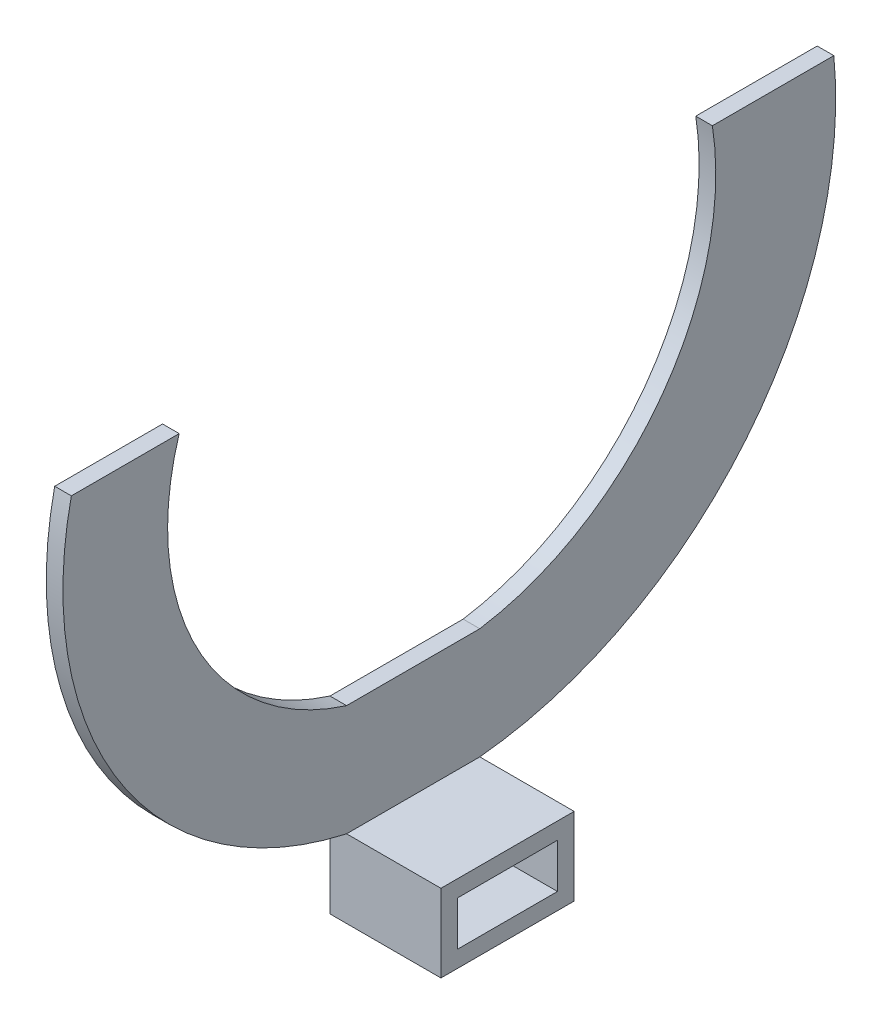
ISO-10303-21;
HEADER;
FILE_DESCRIPTION(('STEP AP214'),'2;1');
FILE_NAME('part.step','',(''),(''),'','','');
FILE_SCHEMA(('AUTOMOTIVE_DESIGN { 1 0 10303 214 1 1 1 1 }'));
ENDSEC;
DATA;
#1=APPLICATION_CONTEXT('core data for automotive mechanical design processes');
#2=APPLICATION_PROTOCOL_DEFINITION('international standard','automotive_design',2000,#1);
#3=PRODUCT_CONTEXT('',#1,'mechanical');
#4=PRODUCT('Part','Part','',(#3));
#5=PRODUCT_RELATED_PRODUCT_CATEGORY('part','',(#4));
#6=PRODUCT_DEFINITION_FORMATION('','',#4);
#7=PRODUCT_DEFINITION_CONTEXT('part definition',#1,'design');
#8=PRODUCT_DEFINITION('design','',#6,#7);
#9=PRODUCT_DEFINITION_SHAPE('','',#8);
#10=(LENGTH_UNIT() NAMED_UNIT(*) SI_UNIT(.MILLI.,.METRE.));
#11=(NAMED_UNIT(*) PLANE_ANGLE_UNIT() SI_UNIT($,.RADIAN.));
#12=(NAMED_UNIT(*) SI_UNIT($,.STERADIAN.) SOLID_ANGLE_UNIT());
#13=UNCERTAINTY_MEASURE_WITH_UNIT(LENGTH_MEASURE(1.E-05),#10,'distance_accuracy_value','');
#14=(GEOMETRIC_REPRESENTATION_CONTEXT(3) GLOBAL_UNCERTAINTY_ASSIGNED_CONTEXT((#13)) GLOBAL_UNIT_ASSIGNED_CONTEXT((#10,
#11,#12)) REPRESENTATION_CONTEXT('',''));
#15=CARTESIAN_POINT('',(0.,0.,0.));
#16=DIRECTION('',(0.,0.,1.));
#17=DIRECTION('',(1.,0.,0.));
#18=AXIS2_PLACEMENT_3D('',#15,#16,#17);
#19=CARTESIAN_POINT('',(20.,14.,0.));
#20=DIRECTION('',(0.,-1.,0.));
#21=DIRECTION('',(0.,0.,-1.));
#22=AXIS2_PLACEMENT_3D('',#19,#20,#21);
#23=PLANE('',#22);
#24=DIRECTION('',(0.,0.,-1.));
#25=VECTOR('',#24,1.);
#26=CARTESIAN_POINT('',(3.,14.,-24.));
#27=LINE('',#26,#25);
#28=CARTESIAN_POINT('',(3.,14.,0.));
#29=VERTEX_POINT('',#28);
#30=CARTESIAN_POINT('',(3.,14.,-24.));
#31=VERTEX_POINT('',#30);
#32=EDGE_CURVE('E253',#29,#31,#27,.T.);
#33=ORIENTED_EDGE('',*,*,#32,.F.);
#34=DIRECTION('',(-1.,0.,0.));
#35=VECTOR('',#34,1.);
#36=CARTESIAN_POINT('',(20.,14.,0.));
#37=LINE('',#36,#35);
#38=CARTESIAN_POINT('',(20.,14.,0.));
#39=VERTEX_POINT('',#38);
#40=EDGE_CURVE('E193',#39,#29,#37,.T.);
#41=ORIENTED_EDGE('',*,*,#40,.F.);
#42=DIRECTION('',(0.,0.,1.));
#43=VECTOR('',#42,1.);
#44=CARTESIAN_POINT('',(20.,14.,0.));
#45=LINE('',#44,#43);
#46=CARTESIAN_POINT('',(20.,14.,-24.));
#47=VERTEX_POINT('',#46);
#48=EDGE_CURVE('E198',#47,#39,#45,.T.);
#49=ORIENTED_EDGE('',*,*,#48,.F.);
#50=DIRECTION('',(-1.,0.,0.));
#51=VECTOR('',#50,1.);
#52=CARTESIAN_POINT('',(20.,14.,-24.));
#53=LINE('',#52,#51);
#54=EDGE_CURVE('E197',#47,#31,#53,.T.);
#55=ORIENTED_EDGE('',*,*,#54,.T.);
#56=EDGE_LOOP('',(#33,#41,#49,#55));
#57=FACE_BOUND('',#56,.T.);
#58=ADVANCED_FACE('F39',(#57),#23,.F.);
#59=CARTESIAN_POINT('',(20.,0.,0.));
#60=DIRECTION('',(-1.,0.,0.));
#61=DIRECTION('',(0.,0.,1.));
#62=AXIS2_PLACEMENT_3D('',#59,#60,#61);
#63=PLANE('',#62);
#64=DIRECTION('',(0.,-1.,0.));
#65=VECTOR('',#64,1.);
#66=CARTESIAN_POINT('',(20.,0.,0.));
#67=LINE('',#66,#65);
#68=CARTESIAN_POINT('',(20.,0.,0.));
#69=VERTEX_POINT('',#68);
#70=EDGE_CURVE('E181',#39,#69,#67,.T.);
#71=ORIENTED_EDGE('',*,*,#70,.T.);
#72=DIRECTION('',(0.,0.,-1.));
#73=VECTOR('',#72,1.);
#74=CARTESIAN_POINT('',(20.,0.,0.));
#75=LINE('',#74,#73);
#76=CARTESIAN_POINT('',(20.,0.,-24.));
#77=VERTEX_POINT('',#76);
#78=EDGE_CURVE('E187',#69,#77,#75,.T.);
#79=ORIENTED_EDGE('',*,*,#78,.T.);
#80=DIRECTION('',(0.,1.,0.));
#81=VECTOR('',#80,1.);
#82=CARTESIAN_POINT('',(20.,0.,-24.));
#83=LINE('',#82,#81);
#84=EDGE_CURVE('E203',#77,#47,#83,.T.);
#85=ORIENTED_EDGE('',*,*,#84,.T.);
#86=ORIENTED_EDGE('',*,*,#48,.T.);
#87=EDGE_LOOP('',(#71,#79,#85,#86));
#88=FACE_BOUND('',#87,.T.);
#89=DIRECTION('',(0.,-1.,0.));
#90=VECTOR('',#89,1.);
#91=CARTESIAN_POINT('',(20.,3.,-3.));
#92=LINE('',#91,#90);
#93=CARTESIAN_POINT('',(20.,11.,-3.));
#94=VERTEX_POINT('',#93);
#95=CARTESIAN_POINT('',(20.,3.,-3.));
#96=VERTEX_POINT('',#95);
#97=EDGE_CURVE('E231',#94,#96,#92,.T.);
#98=ORIENTED_EDGE('',*,*,#97,.F.);
#99=DIRECTION('',(0.,0.,1.));
#100=VECTOR('',#99,1.);
#101=CARTESIAN_POINT('',(20.,11.,-3.));
#102=LINE('',#101,#100);
#103=CARTESIAN_POINT('',(20.,11.,-21.));
#104=VERTEX_POINT('',#103);
#105=EDGE_CURVE('E226',#104,#94,#102,.T.);
#106=ORIENTED_EDGE('',*,*,#105,.F.);
#107=DIRECTION('',(0.,1.,0.));
#108=VECTOR('',#107,1.);
#109=CARTESIAN_POINT('',(20.,3.,-21.));
#110=LINE('',#109,#108);
#111=CARTESIAN_POINT('',(20.,3.,-21.));
#112=VERTEX_POINT('',#111);
#113=EDGE_CURVE('E245',#112,#104,#110,.T.);
#114=ORIENTED_EDGE('',*,*,#113,.F.);
#115=DIRECTION('',(0.,0.,-1.));
#116=VECTOR('',#115,1.);
#117=CARTESIAN_POINT('',(20.,3.,-3.));
#118=LINE('',#117,#116);
#119=EDGE_CURVE('E248',#96,#112,#118,.T.);
#120=ORIENTED_EDGE('',*,*,#119,.F.);
#121=EDGE_LOOP('',(#98,#106,#114,#120));
#122=FACE_BOUND('',#121,.T.);
#123=ADVANCED_FACE('F350',(#88,#122),#63,.F.);
#124=CARTESIAN_POINT('',(0.,0.,0.));
#125=DIRECTION('',(-1.,0.,0.));
#126=DIRECTION('',(0.,0.,1.));
#127=AXIS2_PLACEMENT_3D('',#124,#125,#126);
#128=PLANE('',#127);
#129=DIRECTION('',(0.,-1.,0.));
#130=VECTOR('',#129,1.);
#131=CARTESIAN_POINT('',(0.,0.,0.));
#132=LINE('',#131,#130);
#133=CARTESIAN_POINT('',(0.,14.,0.));
#134=VERTEX_POINT('',#133);
#135=CARTESIAN_POINT('',(0.,0.,0.));
#136=VERTEX_POINT('',#135);
#137=EDGE_CURVE('E189',#134,#136,#132,.T.);
#138=ORIENTED_EDGE('',*,*,#137,.F.);
#139=CARTESIAN_POINT('',(0.,77.560637064683,-13.9683624829845));
#140=DIRECTION('',(1.,0.,0.));
#141=DIRECTION('',(0.,0.,1.));
#142=AXIS2_PLACEMENT_3D('',#139,#140,#141);
#143=CIRCLE('',#142,65.0774133976175);
#144=CARTESIAN_POINT('',(0.,91.5289995476634,49.5922745816994));
#145=VERTEX_POINT('',#144);
#146=EDGE_CURVE('E277',#145,#134,#143,.T.);
#147=ORIENTED_EDGE('',*,*,#146,.F.);
#148=DIRECTION('',(0.,0.,1.));
#149=VECTOR('',#148,1.);
#150=CARTESIAN_POINT('',(0.,91.5289995476634,49.5922745816994));
#151=LINE('',#150,#149);
#152=CARTESIAN_POINT('',(0.,91.5289995476634,30.1601450300538));
#153=VERTEX_POINT('',#152);
#154=EDGE_CURVE('E298',#153,#145,#151,.T.);
#155=ORIENTED_EDGE('',*,*,#154,.F.);
#156=CARTESIAN_POINT('',(0.,77.8445722888607,-13.6844272588087));
#157=DIRECTION('',(-1.,0.,0.));
#158=DIRECTION('',(0.,0.,1.));
#159=AXIS2_PLACEMENT_3D('',#156,#157,#158);
#160=CIRCLE('',#159,45.9304917086107);
#161=CARTESIAN_POINT('',(0.,34.,0.));
#162=VERTEX_POINT('',#161);
#163=EDGE_CURVE('E286',#162,#153,#160,.T.);
#164=ORIENTED_EDGE('',*,*,#163,.F.);
#165=DIRECTION('',(0.,0.,1.));
#166=VECTOR('',#165,1.);
#167=CARTESIAN_POINT('',(0.,34.,-24.));
#168=LINE('',#167,#166);
#169=CARTESIAN_POINT('',(0.,34.,-24.));
#170=VERTEX_POINT('',#169);
#171=EDGE_CURVE('E257',#170,#162,#168,.T.);
#172=ORIENTED_EDGE('',*,*,#171,.F.);
#173=CARTESIAN_POINT('',(0.,83.7193465963251,-16.1903470486617));
#174=DIRECTION('',(-1.,0.,0.));
#175=DIRECTION('',(0.,0.,-1.));
#176=AXIS2_PLACEMENT_3D('',#173,#174,#175);
#177=CIRCLE('',#176,50.3289589121994);
#178=CARTESIAN_POINT('',(0.,91.5289995476634,-65.9096936449868));
#179=VERTEX_POINT('',#178);
#180=EDGE_CURVE('E174',#179,#170,#177,.T.);
#181=ORIENTED_EDGE('',*,*,#180,.F.);
#182=DIRECTION('',(0.,0.,1.));
#183=VECTOR('',#182,1.);
#184=CARTESIAN_POINT('',(0.,91.5289995476634,-65.9096936449868));
#185=LINE('',#184,#183);
#186=CARTESIAN_POINT('',(0.,91.5289995476633,-87.7921343039123));
#187=VERTEX_POINT('',#186);
#188=EDGE_CURVE('E162',#187,#179,#185,.T.);
#189=ORIENTED_EDGE('',*,*,#188,.F.);
#190=CARTESIAN_POINT('',(0.,84.6605669257878,-17.1315673781245));
#191=DIRECTION('',(1.,0.,0.));
#192=DIRECTION('',(0.,0.,-1.));
#193=AXIS2_PLACEMENT_3D('',#190,#191,#192);
#194=CIRCLE('',#193,70.9935989012741);
#195=CARTESIAN_POINT('',(0.,14.,-24.));
#196=VERTEX_POINT('',#195);
#197=EDGE_CURVE('E152',#196,#187,#194,.T.);
#198=ORIENTED_EDGE('',*,*,#197,.F.);
#199=DIRECTION('',(0.,1.,0.));
#200=VECTOR('',#199,1.);
#201=CARTESIAN_POINT('',(0.,0.,-24.));
#202=LINE('',#201,#200);
#203=CARTESIAN_POINT('',(0.,0.,-24.));
#204=VERTEX_POINT('',#203);
#205=EDGE_CURVE('E170',#204,#196,#202,.T.);
#206=ORIENTED_EDGE('',*,*,#205,.F.);
#207=DIRECTION('',(0.,0.,-1.));
#208=VECTOR('',#207,1.);
#209=CARTESIAN_POINT('',(0.,0.,0.));
#210=LINE('',#209,#208);
#211=EDGE_CURVE('E182',#136,#204,#210,.T.);
#212=ORIENTED_EDGE('',*,*,#211,.F.);
#213=EDGE_LOOP('',(#138,#147,#155,#164,#172,#181,#189,#198,#206,#212));
#214=FACE_BOUND('',#213,.T.);
#215=DIRECTION('',(0.,0.,1.));
#216=VECTOR('',#215,1.);
#217=CARTESIAN_POINT('',(0.,11.,-3.));
#218=LINE('',#217,#216);
#219=CARTESIAN_POINT('',(0.,11.,-21.));
#220=VERTEX_POINT('',#219);
#221=CARTESIAN_POINT('',(0.,11.,-3.));
#222=VERTEX_POINT('',#221);
#223=EDGE_CURVE('E227',#220,#222,#218,.T.);
#224=ORIENTED_EDGE('',*,*,#223,.T.);
#225=DIRECTION('',(0.,-1.,0.));
#226=VECTOR('',#225,1.);
#227=CARTESIAN_POINT('',(0.,3.,-3.));
#228=LINE('',#227,#226);
#229=CARTESIAN_POINT('',(0.,3.,-3.));
#230=VERTEX_POINT('',#229);
#231=EDGE_CURVE('E63',#222,#230,#228,.T.);
#232=ORIENTED_EDGE('',*,*,#231,.T.);
#233=DIRECTION('',(0.,0.,-1.));
#234=VECTOR('',#233,1.);
#235=CARTESIAN_POINT('',(0.,3.,-3.));
#236=LINE('',#235,#234);
#237=CARTESIAN_POINT('',(0.,3.,-21.));
#238=VERTEX_POINT('',#237);
#239=EDGE_CURVE('E236',#230,#238,#236,.T.);
#240=ORIENTED_EDGE('',*,*,#239,.T.);
#241=DIRECTION('',(0.,1.,0.));
#242=VECTOR('',#241,1.);
#243=CARTESIAN_POINT('',(0.,3.,-21.));
#244=LINE('',#243,#242);
#245=EDGE_CURVE('E232',#238,#220,#244,.T.);
#246=ORIENTED_EDGE('',*,*,#245,.T.);
#247=EDGE_LOOP('',(#224,#232,#240,#246));
#248=FACE_BOUND('',#247,.T.);
#249=ADVANCED_FACE('F167',(#214,#248),#128,.T.);
#250=CARTESIAN_POINT('',(20.,0.,0.));
#251=DIRECTION('',(0.,0.,-1.));
#252=DIRECTION('',(-1.,0.,0.));
#253=AXIS2_PLACEMENT_3D('',#250,#251,#252);
#254=PLANE('',#253);
#255=ORIENTED_EDGE('',*,*,#40,.T.);
#256=DIRECTION('',(1.,0.,0.));
#257=VECTOR('',#256,1.);
#258=CARTESIAN_POINT('',(0.,14.,0.));
#259=LINE('',#258,#257);
#260=EDGE_CURVE('E258',#134,#29,#259,.T.);
#261=ORIENTED_EDGE('',*,*,#260,.F.);
#262=ORIENTED_EDGE('',*,*,#137,.T.);
#263=DIRECTION('',(-1.,0.,0.));
#264=VECTOR('',#263,1.);
#265=CARTESIAN_POINT('',(20.,0.,0.));
#266=LINE('',#265,#264);
#267=EDGE_CURVE('E11',#69,#136,#266,.T.);
#268=ORIENTED_EDGE('',*,*,#267,.F.);
#269=ORIENTED_EDGE('',*,*,#70,.F.);
#270=EDGE_LOOP('',(#255,#261,#262,#268,#269));
#271=FACE_BOUND('',#270,.T.);
#272=ADVANCED_FACE('F41',(#271),#254,.F.);
#273=CARTESIAN_POINT('',(20.,0.,0.));
#274=DIRECTION('',(0.,1.,0.));
#275=DIRECTION('',(0.,0.,1.));
#276=AXIS2_PLACEMENT_3D('',#273,#274,#275);
#277=PLANE('',#276);
#278=ORIENTED_EDGE('',*,*,#211,.T.);
#279=DIRECTION('',(-1.,0.,0.));
#280=VECTOR('',#279,1.);
#281=CARTESIAN_POINT('',(20.,0.,-24.));
#282=LINE('',#281,#280);
#283=EDGE_CURVE('E48',#77,#204,#282,.T.);
#284=ORIENTED_EDGE('',*,*,#283,.F.);
#285=ORIENTED_EDGE('',*,*,#78,.F.);
#286=ORIENTED_EDGE('',*,*,#267,.T.);
#287=EDGE_LOOP('',(#278,#284,#285,#286));
#288=FACE_BOUND('',#287,.T.);
#289=ADVANCED_FACE('F362',(#288),#277,.F.);
#290=CARTESIAN_POINT('',(20.,0.,-24.));
#291=DIRECTION('',(0.,0.,1.));
#292=DIRECTION('',(1.,0.,0.));
#293=AXIS2_PLACEMENT_3D('',#290,#291,#292);
#294=PLANE('',#293);
#295=ORIENTED_EDGE('',*,*,#205,.T.);
#296=DIRECTION('',(1.,0.,0.));
#297=VECTOR('',#296,1.);
#298=CARTESIAN_POINT('',(0.,14.,-24.));
#299=LINE('',#298,#297);
#300=EDGE_CURVE('E149',#196,#31,#299,.T.);
#301=ORIENTED_EDGE('',*,*,#300,.T.);
#302=ORIENTED_EDGE('',*,*,#54,.F.);
#303=ORIENTED_EDGE('',*,*,#84,.F.);
#304=ORIENTED_EDGE('',*,*,#283,.T.);
#305=EDGE_LOOP('',(#295,#301,#302,#303,#304));
#306=FACE_BOUND('',#305,.T.);
#307=ADVANCED_FACE('F177',(#306),#294,.F.);
#308=CARTESIAN_POINT('',(20.,3.,-3.));
#309=DIRECTION('',(0.,0.,-1.));
#310=DIRECTION('',(-1.,0.,0.));
#311=AXIS2_PLACEMENT_3D('',#308,#309,#310);
#312=PLANE('',#311);
#313=ORIENTED_EDGE('',*,*,#231,.F.);
#314=DIRECTION('',(-1.,0.,0.));
#315=VECTOR('',#314,1.);
#316=CARTESIAN_POINT('',(20.,11.,-3.));
#317=LINE('',#316,#315);
#318=EDGE_CURVE('E223',#94,#222,#317,.T.);
#319=ORIENTED_EDGE('',*,*,#318,.F.);
#320=ORIENTED_EDGE('',*,*,#97,.T.);
#321=DIRECTION('',(-1.,0.,0.));
#322=VECTOR('',#321,1.);
#323=CARTESIAN_POINT('',(20.,3.,-3.));
#324=LINE('',#323,#322);
#325=EDGE_CURVE('E211',#96,#230,#324,.T.);
#326=ORIENTED_EDGE('',*,*,#325,.T.);
#327=EDGE_LOOP('',(#313,#319,#320,#326));
#328=FACE_BOUND('',#327,.T.);
#329=ADVANCED_FACE('F361',(#328),#312,.T.);
#330=CARTESIAN_POINT('',(20.,3.,-3.));
#331=DIRECTION('',(0.,1.,0.));
#332=DIRECTION('',(0.,0.,1.));
#333=AXIS2_PLACEMENT_3D('',#330,#331,#332);
#334=PLANE('',#333);
#335=ORIENTED_EDGE('',*,*,#239,.F.);
#336=ORIENTED_EDGE('',*,*,#325,.F.);
#337=ORIENTED_EDGE('',*,*,#119,.T.);
#338=DIRECTION('',(-1.,0.,0.));
#339=VECTOR('',#338,1.);
#340=CARTESIAN_POINT('',(20.,3.,-21.));
#341=LINE('',#340,#339);
#342=EDGE_CURVE('E216',#112,#238,#341,.T.);
#343=ORIENTED_EDGE('',*,*,#342,.T.);
#344=EDGE_LOOP('',(#335,#336,#337,#343));
#345=FACE_BOUND('',#344,.T.);
#346=ADVANCED_FACE('F380',(#345),#334,.T.);
#347=CARTESIAN_POINT('',(20.,3.,-21.));
#348=DIRECTION('',(0.,0.,1.));
#349=DIRECTION('',(1.,0.,0.));
#350=AXIS2_PLACEMENT_3D('',#347,#348,#349);
#351=PLANE('',#350);
#352=ORIENTED_EDGE('',*,*,#245,.F.);
#353=ORIENTED_EDGE('',*,*,#342,.F.);
#354=ORIENTED_EDGE('',*,*,#113,.T.);
#355=DIRECTION('',(-1.,0.,0.));
#356=VECTOR('',#355,1.);
#357=CARTESIAN_POINT('',(20.,11.,-21.));
#358=LINE('',#357,#356);
#359=EDGE_CURVE('E55',#104,#220,#358,.T.);
#360=ORIENTED_EDGE('',*,*,#359,.T.);
#361=EDGE_LOOP('',(#352,#353,#354,#360));
#362=FACE_BOUND('',#361,.T.);
#363=ADVANCED_FACE('F385',(#362),#351,.T.);
#364=CARTESIAN_POINT('',(20.,11.,-3.));
#365=DIRECTION('',(0.,-1.,0.));
#366=DIRECTION('',(0.,0.,-1.));
#367=AXIS2_PLACEMENT_3D('',#364,#365,#366);
#368=PLANE('',#367);
#369=ORIENTED_EDGE('',*,*,#223,.F.);
#370=ORIENTED_EDGE('',*,*,#359,.F.);
#371=ORIENTED_EDGE('',*,*,#105,.T.);
#372=ORIENTED_EDGE('',*,*,#318,.T.);
#373=EDGE_LOOP('',(#369,#370,#371,#372));
#374=FACE_BOUND('',#373,.T.);
#375=ADVANCED_FACE('F383',(#374),#368,.T.);
#376=CARTESIAN_POINT('',(3.,34.,-24.));
#377=DIRECTION('',(-1.,0.,0.));
#378=DIRECTION('',(0.,0.,1.));
#379=AXIS2_PLACEMENT_3D('',#376,#377,#378);
#380=PLANE('',#379);
#381=ORIENTED_EDGE('',*,*,#32,.T.);
#382=CARTESIAN_POINT('',(3.,84.6605669257878,-17.1315673781245));
#383=DIRECTION('',(1.,0.,0.));
#384=DIRECTION('',(0.,0.,-1.));
#385=AXIS2_PLACEMENT_3D('',#382,#383,#384);
#386=CIRCLE('',#385,70.9935989012741);
#387=CARTESIAN_POINT('',(2.99999999999999,91.5289995476633,-87.7921343039123));
#388=VERTEX_POINT('',#387);
#389=EDGE_CURVE('E155',#31,#388,#386,.T.);
#390=ORIENTED_EDGE('',*,*,#389,.T.);
#391=DIRECTION('',(0.,0.,1.));
#392=VECTOR('',#391,1.);
#393=CARTESIAN_POINT('',(3.,91.5289995476634,-65.9096936449868));
#394=LINE('',#393,#392);
#395=CARTESIAN_POINT('',(3.,91.5289995476634,-65.9096936449868));
#396=VERTEX_POINT('',#395);
#397=EDGE_CURVE('E309',#388,#396,#394,.T.);
#398=ORIENTED_EDGE('',*,*,#397,.T.);
#399=CARTESIAN_POINT('',(3.,83.7193465963251,-16.1903470486617));
#400=DIRECTION('',(-1.,0.,0.));
#401=DIRECTION('',(0.,0.,-1.));
#402=AXIS2_PLACEMENT_3D('',#399,#400,#401);
#403=CIRCLE('',#402,50.3289589121994);
#404=CARTESIAN_POINT('',(3.,34.,-24.));
#405=VERTEX_POINT('',#404);
#406=EDGE_CURVE('E315',#396,#405,#403,.T.);
#407=ORIENTED_EDGE('',*,*,#406,.T.);
#408=DIRECTION('',(0.,0.,-1.));
#409=VECTOR('',#408,1.);
#410=CARTESIAN_POINT('',(3.,34.,-24.));
#411=LINE('',#410,#409);
#412=CARTESIAN_POINT('',(3.,34.,0.));
#413=VERTEX_POINT('',#412);
#414=EDGE_CURVE('E262',#413,#405,#411,.T.);
#415=ORIENTED_EDGE('',*,*,#414,.F.);
#416=CARTESIAN_POINT('',(3.,77.8445722888607,-13.6844272588087));
#417=DIRECTION('',(-1.,0.,0.));
#418=DIRECTION('',(0.,0.,1.));
#419=AXIS2_PLACEMENT_3D('',#416,#417,#418);
#420=CIRCLE('',#419,45.9304917086107);
#421=CARTESIAN_POINT('',(3.00000000000001,91.5289995476634,30.1601450300538));
#422=VERTEX_POINT('',#421);
#423=EDGE_CURVE('E291',#413,#422,#420,.T.);
#424=ORIENTED_EDGE('',*,*,#423,.T.);
#425=DIRECTION('',(0.,0.,1.));
#426=VECTOR('',#425,1.);
#427=CARTESIAN_POINT('',(3.00000000000001,91.5289995476634,49.5922745816994));
#428=LINE('',#427,#426);
#429=CARTESIAN_POINT('',(3.00000000000001,91.5289995476634,49.5922745816994));
#430=VERTEX_POINT('',#429);
#431=EDGE_CURVE('E287',#422,#430,#428,.T.);
#432=ORIENTED_EDGE('',*,*,#431,.T.);
#433=CARTESIAN_POINT('',(3.,77.560637064683,-13.9683624829845));
#434=DIRECTION('',(1.,0.,0.));
#435=DIRECTION('',(0.,0.,1.));
#436=AXIS2_PLACEMENT_3D('',#433,#434,#435);
#437=CIRCLE('',#436,65.0774133976175);
#438=EDGE_CURVE('E282',#430,#29,#437,.T.);
#439=ORIENTED_EDGE('',*,*,#438,.T.);
#440=EDGE_LOOP('',(#381,#390,#398,#407,#415,#424,#432,#439));
#441=FACE_BOUND('',#440,.T.);
#442=ADVANCED_FACE('F336',(#441),#380,.F.);
#443=CARTESIAN_POINT('',(0.,34.,0.));
#444=DIRECTION('',(0.,1.,0.));
#445=DIRECTION('',(0.,0.,1.));
#446=AXIS2_PLACEMENT_3D('',#443,#444,#445);
#447=PLANE('',#446);
#448=ORIENTED_EDGE('',*,*,#171,.T.);
#449=DIRECTION('',(1.,0.,0.));
#450=VECTOR('',#449,1.);
#451=CARTESIAN_POINT('',(0.,34.,0.));
#452=LINE('',#451,#450);
#453=EDGE_CURVE('E266',#162,#413,#452,.T.);
#454=ORIENTED_EDGE('',*,*,#453,.T.);
#455=ORIENTED_EDGE('',*,*,#414,.T.);
#456=DIRECTION('',(-1.,0.,0.));
#457=VECTOR('',#456,1.);
#458=CARTESIAN_POINT('',(0.,34.,-24.));
#459=LINE('',#458,#457);
#460=EDGE_CURVE('E242',#405,#170,#459,.T.);
#461=ORIENTED_EDGE('',*,*,#460,.T.);
#462=EDGE_LOOP('',(#448,#454,#455,#461));
#463=FACE_BOUND('',#462,.T.);
#464=ADVANCED_FACE('F327',(#463),#447,.T.);
#465=CARTESIAN_POINT('',(0.,77.8445722888607,-13.6844272588087));
#466=DIRECTION('',(1.,0.,0.));
#467=DIRECTION('',(0.,0.,-1.));
#468=AXIS2_PLACEMENT_3D('',#465,#466,#467);
#469=CYLINDRICAL_SURFACE('',#468,45.9304917086107);
#470=ORIENTED_EDGE('',*,*,#423,.F.);
#471=ORIENTED_EDGE('',*,*,#453,.F.);
#472=ORIENTED_EDGE('',*,*,#163,.T.);
#473=DIRECTION('',(1.,0.,0.));
#474=VECTOR('',#473,1.);
#475=CARTESIAN_POINT('',(0.,91.5289995476634,30.1601450300538));
#476=LINE('',#475,#474);
#477=EDGE_CURVE('E273',#153,#422,#476,.T.);
#478=ORIENTED_EDGE('',*,*,#477,.T.);
#479=EDGE_LOOP('',(#470,#471,#472,#478));
#480=FACE_BOUND('',#479,.T.);
#481=ADVANCED_FACE('F333',(#480),#469,.F.);
#482=CARTESIAN_POINT('',(0.,77.560637064683,-13.9683624829845));
#483=DIRECTION('',(1.,0.,0.));
#484=DIRECTION('',(0.,0.,-1.));
#485=AXIS2_PLACEMENT_3D('',#482,#483,#484);
#486=CYLINDRICAL_SURFACE('',#485,65.0774133976175);
#487=ORIENTED_EDGE('',*,*,#438,.F.);
#488=DIRECTION('',(1.,0.,0.));
#489=VECTOR('',#488,1.);
#490=CARTESIAN_POINT('',(0.,91.5289995476634,49.5922745816994));
#491=LINE('',#490,#489);
#492=EDGE_CURVE('E276',#145,#430,#491,.T.);
#493=ORIENTED_EDGE('',*,*,#492,.F.);
#494=ORIENTED_EDGE('',*,*,#146,.T.);
#495=ORIENTED_EDGE('',*,*,#260,.T.);
#496=EDGE_LOOP('',(#487,#493,#494,#495));
#497=FACE_BOUND('',#496,.T.);
#498=ADVANCED_FACE('F464',(#497),#486,.T.);
#499=CARTESIAN_POINT('',(0.,91.5289995476634,49.5922745816994));
#500=DIRECTION('',(0.,1.,0.));
#501=DIRECTION('',(0.,0.,1.));
#502=AXIS2_PLACEMENT_3D('',#499,#500,#501);
#503=PLANE('',#502);
#504=ORIENTED_EDGE('',*,*,#431,.F.);
#505=ORIENTED_EDGE('',*,*,#477,.F.);
#506=ORIENTED_EDGE('',*,*,#154,.T.);
#507=ORIENTED_EDGE('',*,*,#492,.T.);
#508=EDGE_LOOP('',(#504,#505,#506,#507));
#509=FACE_BOUND('',#508,.T.);
#510=ADVANCED_FACE('F347',(#509),#503,.T.);
#511=CARTESIAN_POINT('',(0.,83.7193465963251,-16.1903470486617));
#512=DIRECTION('',(1.,0.,0.));
#513=DIRECTION('',(0.,0.,-1.));
#514=AXIS2_PLACEMENT_3D('',#511,#512,#513);
#515=CYLINDRICAL_SURFACE('',#514,50.3289589121994);
#516=ORIENTED_EDGE('',*,*,#406,.F.);
#517=DIRECTION('',(1.,0.,0.));
#518=VECTOR('',#517,1.);
#519=CARTESIAN_POINT('',(0.,91.5289995476634,-65.9096936449868));
#520=LINE('',#519,#518);
#521=EDGE_CURVE('E295',#179,#396,#520,.T.);
#522=ORIENTED_EDGE('',*,*,#521,.F.);
#523=ORIENTED_EDGE('',*,*,#180,.T.);
#524=ORIENTED_EDGE('',*,*,#460,.F.);
#525=EDGE_LOOP('',(#516,#522,#523,#524));
#526=FACE_BOUND('',#525,.T.);
#527=ADVANCED_FACE('F324',(#526),#515,.F.);
#528=CARTESIAN_POINT('',(0.,91.5289995476634,-65.9096936449868));
#529=DIRECTION('',(0.,1.,0.));
#530=DIRECTION('',(0.,0.,1.));
#531=AXIS2_PLACEMENT_3D('',#528,#529,#530);
#532=PLANE('',#531);
#533=ORIENTED_EDGE('',*,*,#397,.F.);
#534=DIRECTION('',(1.,0.,0.));
#535=VECTOR('',#534,1.);
#536=CARTESIAN_POINT('',(0.,91.5289995476633,-87.7921343039123));
#537=LINE('',#536,#535);
#538=EDGE_CURVE('E161',#187,#388,#537,.T.);
#539=ORIENTED_EDGE('',*,*,#538,.F.);
#540=ORIENTED_EDGE('',*,*,#188,.T.);
#541=ORIENTED_EDGE('',*,*,#521,.T.);
#542=EDGE_LOOP('',(#533,#539,#540,#541));
#543=FACE_BOUND('',#542,.T.);
#544=ADVANCED_FACE('F339',(#543),#532,.T.);
#545=CARTESIAN_POINT('',(0.,84.6605669257878,-17.1315673781245));
#546=DIRECTION('',(1.,0.,0.));
#547=DIRECTION('',(0.,0.,-1.));
#548=AXIS2_PLACEMENT_3D('',#545,#546,#547);
#549=CYLINDRICAL_SURFACE('',#548,70.9935989012741);
#550=ORIENTED_EDGE('',*,*,#389,.F.);
#551=ORIENTED_EDGE('',*,*,#300,.F.);
#552=ORIENTED_EDGE('',*,*,#197,.T.);
#553=ORIENTED_EDGE('',*,*,#538,.T.);
#554=EDGE_LOOP('',(#550,#551,#552,#553));
#555=FACE_BOUND('',#554,.T.);
#556=ADVANCED_FACE('F151',(#555),#549,.T.);
#557=CLOSED_SHELL('',(#58,#123,#249,#272,#289,#307,#329,#346,#363,#375,#442,#464,#481,#498,#510,
#527,#544,#556));
#558=MANIFOLD_SOLID_BREP('B2',#557);
#559=ADVANCED_BREP_SHAPE_REPRESENTATION('',(#18,#558),#14);
#560=SHAPE_DEFINITION_REPRESENTATION(#9,#559);
ENDSEC;
END-ISO-10303-21;
